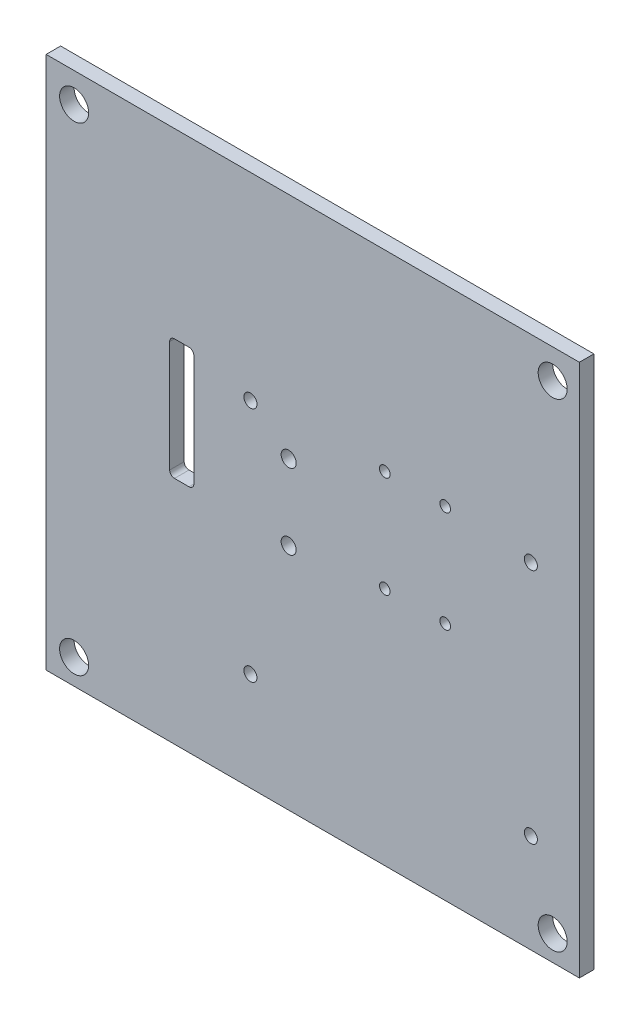
ISO-10303-21;
HEADER;
FILE_DESCRIPTION(('STEP AP214'),'2;1');
FILE_NAME('part.step','',(''),(''),'','','');
FILE_SCHEMA(('AUTOMOTIVE_DESIGN { 1 0 10303 214 1 1 1 1 }'));
ENDSEC;
DATA;
#1=APPLICATION_CONTEXT('core data for automotive mechanical design processes');
#2=APPLICATION_PROTOCOL_DEFINITION('international standard','automotive_design',2000,#1);
#3=PRODUCT_CONTEXT('',#1,'mechanical');
#4=PRODUCT('Part','Part','',(#3));
#5=PRODUCT_RELATED_PRODUCT_CATEGORY('part','',(#4));
#6=PRODUCT_DEFINITION_FORMATION('','',#4);
#7=PRODUCT_DEFINITION_CONTEXT('part definition',#1,'design');
#8=PRODUCT_DEFINITION('design','',#6,#7);
#9=PRODUCT_DEFINITION_SHAPE('','',#8);
#10=(LENGTH_UNIT() NAMED_UNIT(*) SI_UNIT(.MILLI.,.METRE.));
#11=(NAMED_UNIT(*) PLANE_ANGLE_UNIT() SI_UNIT($,.RADIAN.));
#12=(NAMED_UNIT(*) SI_UNIT($,.STERADIAN.) SOLID_ANGLE_UNIT());
#13=UNCERTAINTY_MEASURE_WITH_UNIT(LENGTH_MEASURE(1.E-05),#10,'distance_accuracy_value','');
#14=(GEOMETRIC_REPRESENTATION_CONTEXT(3) GLOBAL_UNCERTAINTY_ASSIGNED_CONTEXT((#13)) GLOBAL_UNIT_ASSIGNED_CONTEXT((#10,
#11,#12)) REPRESENTATION_CONTEXT('',''));
#15=CARTESIAN_POINT('',(0.,0.,0.));
#16=DIRECTION('',(0.,0.,1.));
#17=DIRECTION('',(1.,0.,0.));
#18=AXIS2_PLACEMENT_3D('',#15,#16,#17);
#19=CARTESIAN_POINT('',(0.,0.,998.500000000021));
#20=DIRECTION('',(0.,0.,-1.));
#21=DIRECTION('',(-1.,0.,0.));
#22=AXIS2_PLACEMENT_3D('',#19,#20,#21);
#23=PLANE('',#22);
#24=CARTESIAN_POINT('',(14.9,15.4701542651043,998.500000000021));
#25=DIRECTION('',(0.,0.,-1.));
#26=DIRECTION('',(-1.,0.,0.));
#27=AXIS2_PLACEMENT_3D('',#24,#25,#26);
#28=CIRCLE('',#27,1.1);
#29=CARTESIAN_POINT('',(13.8,15.4701542651043,998.500000000021));
#30=VERTEX_POINT('',#29);
#31=EDGE_CURVE('E174',#30,#30,#28,.T.);
#32=ORIENTED_EDGE('',*,*,#31,.F.);
#33=EDGE_LOOP('',(#32));
#34=FACE_BOUND('',#33,.T.);
#35=CARTESIAN_POINT('',(27.4000000000001,-5.52984573489571,998.500000000021));
#36=DIRECTION('',(0.,0.,1.));
#37=DIRECTION('',(1.,0.,0.));
#38=AXIS2_PLACEMENT_3D('',#35,#36,#37);
#39=CIRCLE('',#38,1.1);
#40=CARTESIAN_POINT('',(28.5000000000001,-5.52984573489571,998.500000000021));
#41=VERTEX_POINT('',#40);
#42=EDGE_CURVE('E151',#41,#41,#39,.T.);
#43=ORIENTED_EDGE('',*,*,#42,.T.);
#44=EDGE_LOOP('',(#43));
#45=FACE_BOUND('',#44,.T.);
#46=DIRECTION('',(0.,-1.,0.));
#47=VECTOR('',#46,1.);
#48=CARTESIAN_POINT('',(-24.6000000000001,16.4701542651043,998.500000000021));
#49=LINE('',#48,#47);
#50=CARTESIAN_POINT('',(-24.6000000000001,16.4701542651043,998.500000000021));
#51=VERTEX_POINT('',#50);
#52=CARTESIAN_POINT('',(-24.6000000000001,-6.52984573489571,998.500000000021));
#53=VERTEX_POINT('',#52);
#54=EDGE_CURVE('E54',#51,#53,#49,.T.);
#55=ORIENTED_EDGE('',*,*,#54,.F.);
#56=CARTESIAN_POINT('',(-25.6000000000001,16.4701542651043,998.500000000021));
#57=DIRECTION('',(0.,0.,-1.));
#58=DIRECTION('',(-1.,0.,0.));
#59=AXIS2_PLACEMENT_3D('',#56,#57,#58);
#60=CIRCLE('',#59,1.);
#61=CARTESIAN_POINT('',(-25.6000000000001,17.4701542651043,998.500000000021));
#62=VERTEX_POINT('',#61);
#63=EDGE_CURVE('E136',#62,#51,#60,.T.);
#64=ORIENTED_EDGE('',*,*,#63,.F.);
#65=DIRECTION('',(-1.,0.,0.));
#66=VECTOR('',#65,1.);
#67=CARTESIAN_POINT('',(-25.6000000000001,17.4701542651043,998.500000000021));
#68=LINE('',#67,#66);
#69=CARTESIAN_POINT('',(-28.6000000000001,17.4701542651043,998.500000000021));
#70=VERTEX_POINT('',#69);
#71=EDGE_CURVE('E141',#62,#70,#68,.T.);
#72=ORIENTED_EDGE('',*,*,#71,.T.);
#73=CARTESIAN_POINT('',(-28.6000000000001,16.4701542651043,998.500000000021));
#74=DIRECTION('',(0.,0.,1.));
#75=DIRECTION('',(1.,0.,0.));
#76=AXIS2_PLACEMENT_3D('',#73,#74,#75);
#77=CIRCLE('',#76,1.);
#78=CARTESIAN_POINT('',(-29.6000000000001,16.4701542651043,998.500000000021));
#79=VERTEX_POINT('',#78);
#80=EDGE_CURVE('E418',#70,#79,#77,.T.);
#81=ORIENTED_EDGE('',*,*,#80,.T.);
#82=DIRECTION('',(0.,-1.,0.));
#83=VECTOR('',#82,1.);
#84=CARTESIAN_POINT('',(-29.6000000000001,16.4701542651043,998.500000000021));
#85=LINE('',#84,#83);
#86=CARTESIAN_POINT('',(-29.6000000000001,-6.52984573489571,998.500000000021));
#87=VERTEX_POINT('',#86);
#88=EDGE_CURVE('E421',#79,#87,#85,.T.);
#89=ORIENTED_EDGE('',*,*,#88,.T.);
#90=CARTESIAN_POINT('',(-28.6000000000001,-6.52984573489571,998.500000000021));
#91=DIRECTION('',(0.,0.,-1.));
#92=DIRECTION('',(-1.,0.,0.));
#93=AXIS2_PLACEMENT_3D('',#90,#91,#92);
#94=CIRCLE('',#93,1.);
#95=CARTESIAN_POINT('',(-28.6000000000001,-7.52984573489571,998.500000000021));
#96=VERTEX_POINT('',#95);
#97=EDGE_CURVE('E424',#96,#87,#94,.T.);
#98=ORIENTED_EDGE('',*,*,#97,.F.);
#99=DIRECTION('',(-1.,0.,0.));
#100=VECTOR('',#99,1.);
#101=CARTESIAN_POINT('',(-25.6000000000001,-7.52984573489571,998.500000000021));
#102=LINE('',#101,#100);
#103=CARTESIAN_POINT('',(-25.6000000000001,-7.52984573489571,998.500000000021));
#104=VERTEX_POINT('',#103);
#105=EDGE_CURVE('E153',#104,#96,#102,.T.);
#106=ORIENTED_EDGE('',*,*,#105,.F.);
#107=CARTESIAN_POINT('',(-25.6000000000001,-6.52984573489571,998.500000000021));
#108=DIRECTION('',(0.,0.,-1.));
#109=DIRECTION('',(-1.,0.,0.));
#110=AXIS2_PLACEMENT_3D('',#107,#108,#109);
#111=CIRCLE('',#110,1.);
#112=EDGE_CURVE('E147',#53,#104,#111,.T.);
#113=ORIENTED_EDGE('',*,*,#112,.F.);
#114=EDGE_LOOP('',(#55,#64,#72,#81,#89,#98,#106,#113));
#115=FACE_BOUND('',#114,.T.);
#116=CARTESIAN_POINT('',(27.4,15.4701542651043,998.500000000021));
#117=DIRECTION('',(0.,0.,-1.));
#118=DIRECTION('',(-1.,0.,0.));
#119=AXIS2_PLACEMENT_3D('',#116,#117,#118);
#120=CIRCLE('',#119,1.1);
#121=CARTESIAN_POINT('',(26.3,15.4701542651043,998.500000000021));
#122=VERTEX_POINT('',#121);
#123=EDGE_CURVE('E177',#122,#122,#120,.T.);
#124=ORIENTED_EDGE('',*,*,#123,.F.);
#125=EDGE_LOOP('',(#124));
#126=FACE_BOUND('',#125,.T.);
#127=CARTESIAN_POINT('',(-4.98093579391663,7.77875,998.500000000021));
#128=DIRECTION('',(0.,0.,-1.));
#129=DIRECTION('',(-1.,0.,0.));
#130=AXIS2_PLACEMENT_3D('',#127,#128,#129);
#131=CIRCLE('',#130,1.55575);
#132=CARTESIAN_POINT('',(-6.53668579391663,7.77875,998.500000000021));
#133=VERTEX_POINT('',#132);
#134=EDGE_CURVE('E197',#133,#133,#131,.T.);
#135=ORIENTED_EDGE('',*,*,#134,.F.);
#136=EDGE_LOOP('',(#135));
#137=FACE_BOUND('',#136,.T.);
#138=CARTESIAN_POINT('',(-4.98093579391663,-7.77875,998.500000000021));
#139=DIRECTION('',(0.,0.,-1.));
#140=DIRECTION('',(-1.,0.,0.));
#141=AXIS2_PLACEMENT_3D('',#138,#139,#140);
#142=CIRCLE('',#141,1.55575);
#143=CARTESIAN_POINT('',(-6.53668579391663,-7.77875,998.500000000021));
#144=VERTEX_POINT('',#143);
#145=EDGE_CURVE('E200',#144,#144,#142,.T.);
#146=ORIENTED_EDGE('',*,*,#145,.F.);
#147=EDGE_LOOP('',(#146));
#148=FACE_BOUND('',#147,.T.);
#149=CARTESIAN_POINT('',(45.1146732207479,14.2701542651047,998.500000000021));
#150=DIRECTION('',(0.,0.,-1.));
#151=DIRECTION('',(-1.,0.,0.));
#152=AXIS2_PLACEMENT_3D('',#149,#150,#151);
#153=CIRCLE('',#152,1.35);
#154=CARTESIAN_POINT('',(43.7646732207479,14.2701542651047,998.500000000021));
#155=VERTEX_POINT('',#154);
#156=EDGE_CURVE('E218',#155,#155,#153,.T.);
#157=ORIENTED_EDGE('',*,*,#156,.F.);
#158=EDGE_LOOP('',(#157));
#159=FACE_BOUND('',#158,.T.);
#160=CARTESIAN_POINT('',(45.1146732207481,-34.7298457348953,998.500000000021));
#161=DIRECTION('',(0.,0.,-1.));
#162=DIRECTION('',(-1.,0.,0.));
#163=AXIS2_PLACEMENT_3D('',#160,#161,#162);
#164=CIRCLE('',#163,1.35000000000014);
#165=CARTESIAN_POINT('',(43.7646732207479,-34.7298457348953,998.500000000021));
#166=VERTEX_POINT('',#165);
#167=EDGE_CURVE('E212',#166,#166,#164,.T.);
#168=ORIENTED_EDGE('',*,*,#167,.F.);
#169=EDGE_LOOP('',(#168));
#170=FACE_BOUND('',#169,.T.);
#171=CARTESIAN_POINT('',(-12.8853267792518,-34.7298457348957,998.500000000021));
#172=DIRECTION('',(0.,0.,-1.));
#173=DIRECTION('',(-1.,0.,0.));
#174=AXIS2_PLACEMENT_3D('',#171,#172,#173);
#175=CIRCLE('',#174,1.35);
#176=CARTESIAN_POINT('',(-14.2353267792518,-34.7298457348957,998.500000000021));
#177=VERTEX_POINT('',#176);
#178=EDGE_CURVE('E205',#177,#177,#175,.T.);
#179=ORIENTED_EDGE('',*,*,#178,.F.);
#180=EDGE_LOOP('',(#179));
#181=FACE_BOUND('',#180,.T.);
#182=CARTESIAN_POINT('',(-12.8853267792523,14.2701542651043,998.500000000021));
#183=DIRECTION('',(0.,0.,-1.));
#184=DIRECTION('',(-1.,0.,0.));
#185=AXIS2_PLACEMENT_3D('',#182,#183,#184);
#186=CIRCLE('',#185,1.35000000000013);
#187=CARTESIAN_POINT('',(-14.2353267792524,14.2701542651043,998.500000000021));
#188=VERTEX_POINT('',#187);
#189=EDGE_CURVE('E208',#188,#188,#186,.T.);
#190=ORIENTED_EDGE('',*,*,#189,.F.);
#191=EDGE_LOOP('',(#190));
#192=FACE_BOUND('',#191,.T.);
#193=CARTESIAN_POINT('',(49.6312888891551,49.0686864415892,998.500000000021));
#194=DIRECTION('',(0.,0.,1.));
#195=DIRECTION('',(1.,0.,0.));
#196=AXIS2_PLACEMENT_3D('',#193,#194,#195);
#197=CIRCLE('',#196,2.99999999999105);
#198=CARTESIAN_POINT('',(52.6312888891462,49.0686864415892,998.500000000021));
#199=VERTEX_POINT('',#198);
#200=EDGE_CURVE('E229',#199,#199,#197,.T.);
#201=ORIENTED_EDGE('',*,*,#200,.T.);
#202=EDGE_LOOP('',(#201));
#203=FACE_BOUND('',#202,.T.);
#204=CARTESIAN_POINT('',(-49.3636604769884,-49.9262629245005,998.500000000021));
#205=DIRECTION('',(0.,0.,1.));
#206=DIRECTION('',(1.,0.,0.));
#207=AXIS2_PLACEMENT_3D('',#204,#205,#206);
#208=CIRCLE('',#207,3.00000000000893);
#209=CARTESIAN_POINT('',(-46.3636604769795,-49.9262629245005,998.500000000021));
#210=VERTEX_POINT('',#209);
#211=EDGE_CURVE('E235',#210,#210,#208,.T.);
#212=ORIENTED_EDGE('',*,*,#211,.T.);
#213=EDGE_LOOP('',(#212));
#214=FACE_BOUND('',#213,.T.);
#215=CARTESIAN_POINT('',(49.6312888891282,-49.9262629245274,998.500000000021));
#216=DIRECTION('',(0.,0.,1.));
#217=DIRECTION('',(1.,0.,0.));
#218=AXIS2_PLACEMENT_3D('',#215,#216,#217);
#219=CIRCLE('',#218,3.00000000001683);
#220=CARTESIAN_POINT('',(52.631288889145,-49.9262629245274,998.500000000021));
#221=VERTEX_POINT('',#220);
#222=EDGE_CURVE('E241',#221,#221,#219,.T.);
#223=ORIENTED_EDGE('',*,*,#222,.T.);
#224=EDGE_LOOP('',(#223));
#225=FACE_BOUND('',#224,.T.);
#226=CARTESIAN_POINT('',(-49.3636604769615,49.0686864416162,998.500000000021));
#227=DIRECTION('',(0.,0.,1.));
#228=DIRECTION('',(1.,0.,0.));
#229=AXIS2_PLACEMENT_3D('',#226,#227,#228);
#230=CIRCLE('',#229,2.99999999998319);
#231=CARTESIAN_POINT('',(-46.3636604769783,49.0686864416162,998.500000000021));
#232=VERTEX_POINT('',#231);
#233=EDGE_CURVE('E247',#232,#232,#230,.T.);
#234=ORIENTED_EDGE('',*,*,#233,.T.);
#235=EDGE_LOOP('',(#234));
#236=FACE_BOUND('',#235,.T.);
#237=DIRECTION('',(0.,-1.,0.));
#238=VECTOR('',#237,1.);
#239=CARTESIAN_POINT('',(-55.1543289325508,-55.1543289325508,998.500000000021));
#240=LINE('',#239,#238);
#241=CARTESIAN_POINT('',(-55.1543289325506,55.1543289325506,998.500000000021));
#242=VERTEX_POINT('',#241);
#243=CARTESIAN_POINT('',(-55.1543289325508,-55.1543289325508,998.500000000021));
#244=VERTEX_POINT('',#243);
#245=EDGE_CURVE('E253',#242,#244,#240,.T.);
#246=ORIENTED_EDGE('',*,*,#245,.F.);
#247=DIRECTION('',(-1.,0.,0.));
#248=VECTOR('',#247,1.);
#249=CARTESIAN_POINT('',(-55.1543289325506,55.1543289325506,998.500000000021));
#250=LINE('',#249,#248);
#251=CARTESIAN_POINT('',(55.1543289325504,55.1543289325504,998.500000000021));
#252=VERTEX_POINT('',#251);
#253=EDGE_CURVE('E263',#252,#242,#250,.T.);
#254=ORIENTED_EDGE('',*,*,#253,.F.);
#255=DIRECTION('',(0.,1.,0.));
#256=VECTOR('',#255,1.);
#257=CARTESIAN_POINT('',(55.1543289325504,-55.1543289325508,998.500000000021));
#258=LINE('',#257,#256);
#259=CARTESIAN_POINT('',(55.1543289325504,-55.1543289325508,998.500000000021));
#260=VERTEX_POINT('',#259);
#261=EDGE_CURVE('E260',#260,#252,#258,.T.);
#262=ORIENTED_EDGE('',*,*,#261,.F.);
#263=DIRECTION('',(1.,0.,0.));
#264=VECTOR('',#263,1.);
#265=CARTESIAN_POINT('',(-55.1543289325508,-55.1543289325508,998.500000000021));
#266=LINE('',#265,#264);
#267=EDGE_CURVE('E256',#244,#260,#266,.T.);
#268=ORIENTED_EDGE('',*,*,#267,.F.);
#269=EDGE_LOOP('',(#246,#254,#262,#268));
#270=FACE_BOUND('',#269,.T.);
#271=CARTESIAN_POINT('',(14.9000000000001,-5.52984573489572,998.500000000021));
#272=DIRECTION('',(0.,0.,1.));
#273=DIRECTION('',(1.,0.,0.));
#274=AXIS2_PLACEMENT_3D('',#271,#272,#273);
#275=CIRCLE('',#274,1.1);
#276=CARTESIAN_POINT('',(16.0000000000001,-5.52984573489572,998.500000000021));
#277=VERTEX_POINT('',#276);
#278=EDGE_CURVE('E181',#277,#277,#275,.T.);
#279=ORIENTED_EDGE('',*,*,#278,.T.);
#280=EDGE_LOOP('',(#279));
#281=FACE_BOUND('',#280,.T.);
#282=ADVANCED_FACE('F37',(#34,#45,#115,#126,#137,#148,#159,#170,#181,#192,#203,#214,#225,#236,
#270,#281),#23,.T.);
#283=CARTESIAN_POINT('',(0.,0.,1001.50000000002));
#284=DIRECTION('',(0.,0.,-1.));
#285=DIRECTION('',(-1.,0.,0.));
#286=AXIS2_PLACEMENT_3D('',#283,#284,#285);
#287=PLANE('',#286);
#288=CARTESIAN_POINT('',(14.9,15.4701542651043,1001.50000000002));
#289=DIRECTION('',(0.,0.,-1.));
#290=DIRECTION('',(-1.,0.,0.));
#291=AXIS2_PLACEMENT_3D('',#288,#289,#290);
#292=CIRCLE('',#291,1.1);
#293=CARTESIAN_POINT('',(13.8,15.4701542651043,1001.50000000002));
#294=VERTEX_POINT('',#293);
#295=EDGE_CURVE('E178',#294,#294,#292,.T.);
#296=ORIENTED_EDGE('',*,*,#295,.T.);
#297=EDGE_LOOP('',(#296));
#298=FACE_BOUND('',#297,.T.);
#299=CARTESIAN_POINT('',(-25.6000000000001,16.4701542651043,1001.50000000002));
#300=DIRECTION('',(0.,0.,-1.));
#301=DIRECTION('',(-1.,0.,0.));
#302=AXIS2_PLACEMENT_3D('',#299,#300,#301);
#303=CIRCLE('',#302,1.);
#304=CARTESIAN_POINT('',(-25.6000000000001,17.4701542651043,1001.50000000002));
#305=VERTEX_POINT('',#304);
#306=CARTESIAN_POINT('',(-24.6000000000001,16.4701542651043,1001.50000000002));
#307=VERTEX_POINT('',#306);
#308=EDGE_CURVE('E157',#305,#307,#303,.T.);
#309=ORIENTED_EDGE('',*,*,#308,.T.);
#310=DIRECTION('',(0.,-1.,0.));
#311=VECTOR('',#310,1.);
#312=CARTESIAN_POINT('',(-24.6000000000001,16.4701542651043,1001.50000000002));
#313=LINE('',#312,#311);
#314=CARTESIAN_POINT('',(-24.6000000000001,-6.52984573489571,1001.50000000002));
#315=VERTEX_POINT('',#314);
#316=EDGE_CURVE('E129',#307,#315,#313,.T.);
#317=ORIENTED_EDGE('',*,*,#316,.T.);
#318=CARTESIAN_POINT('',(-25.6000000000001,-6.52984573489571,1001.50000000002));
#319=DIRECTION('',(0.,0.,-1.));
#320=DIRECTION('',(-1.,0.,0.));
#321=AXIS2_PLACEMENT_3D('',#318,#319,#320);
#322=CIRCLE('',#321,1.);
#323=CARTESIAN_POINT('',(-25.6000000000001,-7.52984573489571,1001.50000000002));
#324=VERTEX_POINT('',#323);
#325=EDGE_CURVE('E170',#315,#324,#322,.T.);
#326=ORIENTED_EDGE('',*,*,#325,.T.);
#327=DIRECTION('',(-1.,0.,0.));
#328=VECTOR('',#327,1.);
#329=CARTESIAN_POINT('',(-25.6000000000001,-7.52984573489571,1001.50000000002));
#330=LINE('',#329,#328);
#331=CARTESIAN_POINT('',(-28.6000000000001,-7.52984573489571,1001.50000000002));
#332=VERTEX_POINT('',#331);
#333=EDGE_CURVE('E62',#324,#332,#330,.T.);
#334=ORIENTED_EDGE('',*,*,#333,.T.);
#335=CARTESIAN_POINT('',(-28.6000000000001,-6.52984573489571,1001.50000000002));
#336=DIRECTION('',(0.,0.,-1.));
#337=DIRECTION('',(-1.,0.,0.));
#338=AXIS2_PLACEMENT_3D('',#335,#336,#337);
#339=CIRCLE('',#338,1.);
#340=CARTESIAN_POINT('',(-29.6000000000001,-6.52984573489571,1001.50000000002));
#341=VERTEX_POINT('',#340);
#342=EDGE_CURVE('E166',#332,#341,#339,.T.);
#343=ORIENTED_EDGE('',*,*,#342,.T.);
#344=DIRECTION('',(0.,-1.,0.));
#345=VECTOR('',#344,1.);
#346=CARTESIAN_POINT('',(-29.6000000000001,16.4701542651043,1001.50000000002));
#347=LINE('',#346,#345);
#348=CARTESIAN_POINT('',(-29.6000000000001,16.4701542651043,1001.50000000002));
#349=VERTEX_POINT('',#348);
#350=EDGE_CURVE('E164',#349,#341,#347,.T.);
#351=ORIENTED_EDGE('',*,*,#350,.F.);
#352=CARTESIAN_POINT('',(-28.6000000000001,16.4701542651043,1001.50000000002));
#353=DIRECTION('',(0.,0.,1.));
#354=DIRECTION('',(1.,0.,0.));
#355=AXIS2_PLACEMENT_3D('',#352,#353,#354);
#356=CIRCLE('',#355,1.);
#357=CARTESIAN_POINT('',(-28.6000000000001,17.4701542651043,1001.50000000002));
#358=VERTEX_POINT('',#357);
#359=EDGE_CURVE('E162',#358,#349,#356,.T.);
#360=ORIENTED_EDGE('',*,*,#359,.F.);
#361=DIRECTION('',(-1.,0.,0.));
#362=VECTOR('',#361,1.);
#363=CARTESIAN_POINT('',(-25.6000000000001,17.4701542651043,1001.50000000002));
#364=LINE('',#363,#362);
#365=EDGE_CURVE('E159',#305,#358,#364,.T.);
#366=ORIENTED_EDGE('',*,*,#365,.F.);
#367=EDGE_LOOP('',(#309,#317,#326,#334,#343,#351,#360,#366));
#368=FACE_BOUND('',#367,.T.);
#369=CARTESIAN_POINT('',(27.4,15.4701542651043,1001.50000000002));
#370=DIRECTION('',(0.,0.,-1.));
#371=DIRECTION('',(-1.,0.,0.));
#372=AXIS2_PLACEMENT_3D('',#369,#370,#371);
#373=CIRCLE('',#372,1.1);
#374=CARTESIAN_POINT('',(26.3,15.4701542651043,1001.50000000002));
#375=VERTEX_POINT('',#374);
#376=EDGE_CURVE('E187',#375,#375,#373,.T.);
#377=ORIENTED_EDGE('',*,*,#376,.T.);
#378=EDGE_LOOP('',(#377));
#379=FACE_BOUND('',#378,.T.);
#380=CARTESIAN_POINT('',(-4.98093579391663,7.77875,1001.50000000002));
#381=DIRECTION('',(0.,0.,-1.));
#382=DIRECTION('',(-1.,0.,0.));
#383=AXIS2_PLACEMENT_3D('',#380,#381,#382);
#384=CIRCLE('',#383,1.55575);
#385=CARTESIAN_POINT('',(-6.53668579391663,7.77875,1001.50000000002));
#386=VERTEX_POINT('',#385);
#387=EDGE_CURVE('E193',#386,#386,#384,.T.);
#388=ORIENTED_EDGE('',*,*,#387,.T.);
#389=EDGE_LOOP('',(#388));
#390=FACE_BOUND('',#389,.T.);
#391=CARTESIAN_POINT('',(-4.98093579391663,-7.77875,1001.50000000002));
#392=DIRECTION('',(0.,0.,-1.));
#393=DIRECTION('',(-1.,0.,0.));
#394=AXIS2_PLACEMENT_3D('',#391,#392,#393);
#395=CIRCLE('',#394,1.55575);
#396=CARTESIAN_POINT('',(-6.53668579391663,-7.77875,1001.50000000002));
#397=VERTEX_POINT('',#396);
#398=EDGE_CURVE('E190',#397,#397,#395,.T.);
#399=ORIENTED_EDGE('',*,*,#398,.T.);
#400=EDGE_LOOP('',(#399));
#401=FACE_BOUND('',#400,.T.);
#402=CARTESIAN_POINT('',(45.1146732207479,14.2701542651047,1001.50000000002));
#403=DIRECTION('',(0.,0.,-1.));
#404=DIRECTION('',(-1.,0.,0.));
#405=AXIS2_PLACEMENT_3D('',#402,#403,#404);
#406=CIRCLE('',#405,1.35);
#407=CARTESIAN_POINT('',(43.7646732207479,14.2701542651047,1001.50000000002));
#408=VERTEX_POINT('',#407);
#409=EDGE_CURVE('E196',#408,#408,#406,.T.);
#410=ORIENTED_EDGE('',*,*,#409,.T.);
#411=EDGE_LOOP('',(#410));
#412=FACE_BOUND('',#411,.T.);
#413=CARTESIAN_POINT('',(45.1146732207481,-34.7298457348953,1001.50000000002));
#414=DIRECTION('',(0.,0.,-1.));
#415=DIRECTION('',(-1.,0.,0.));
#416=AXIS2_PLACEMENT_3D('',#413,#414,#415);
#417=CIRCLE('',#416,1.35000000000014);
#418=CARTESIAN_POINT('',(43.7646732207479,-34.7298457348953,1001.50000000002));
#419=VERTEX_POINT('',#418);
#420=EDGE_CURVE('E215',#419,#419,#417,.T.);
#421=ORIENTED_EDGE('',*,*,#420,.T.);
#422=EDGE_LOOP('',(#421));
#423=FACE_BOUND('',#422,.T.);
#424=CARTESIAN_POINT('',(-12.8853267792518,-34.7298457348957,1001.50000000002));
#425=DIRECTION('',(0.,0.,-1.));
#426=DIRECTION('',(-1.,0.,0.));
#427=AXIS2_PLACEMENT_3D('',#424,#425,#426);
#428=CIRCLE('',#427,1.35);
#429=CARTESIAN_POINT('',(-14.2353267792518,-34.7298457348957,1001.50000000002));
#430=VERTEX_POINT('',#429);
#431=EDGE_CURVE('E209',#430,#430,#428,.T.);
#432=ORIENTED_EDGE('',*,*,#431,.T.);
#433=EDGE_LOOP('',(#432));
#434=FACE_BOUND('',#433,.T.);
#435=CARTESIAN_POINT('',(-12.8853267792523,14.2701542651043,1001.50000000002));
#436=DIRECTION('',(0.,0.,-1.));
#437=DIRECTION('',(-1.,0.,0.));
#438=AXIS2_PLACEMENT_3D('',#435,#436,#437);
#439=CIRCLE('',#438,1.35000000000013);
#440=CARTESIAN_POINT('',(-14.2353267792524,14.2701542651043,1001.50000000002));
#441=VERTEX_POINT('',#440);
#442=EDGE_CURVE('E223',#441,#441,#439,.T.);
#443=ORIENTED_EDGE('',*,*,#442,.T.);
#444=EDGE_LOOP('',(#443));
#445=FACE_BOUND('',#444,.T.);
#446=CARTESIAN_POINT('',(49.6312888891551,49.0686864415892,1001.50000000002));
#447=DIRECTION('',(0.,0.,1.));
#448=DIRECTION('',(1.,0.,0.));
#449=AXIS2_PLACEMENT_3D('',#446,#447,#448);
#450=CIRCLE('',#449,2.99999999999105);
#451=CARTESIAN_POINT('',(52.6312888891462,49.0686864415892,1001.50000000002));
#452=VERTEX_POINT('',#451);
#453=EDGE_CURVE('E226',#452,#452,#450,.T.);
#454=ORIENTED_EDGE('',*,*,#453,.F.);
#455=EDGE_LOOP('',(#454));
#456=FACE_BOUND('',#455,.T.);
#457=CARTESIAN_POINT('',(-49.3636604769884,-49.9262629245005,1001.50000000002));
#458=DIRECTION('',(0.,0.,1.));
#459=DIRECTION('',(1.,0.,0.));
#460=AXIS2_PLACEMENT_3D('',#457,#458,#459);
#461=CIRCLE('',#460,3.00000000000893);
#462=CARTESIAN_POINT('',(-46.3636604769795,-49.9262629245005,1001.50000000002));
#463=VERTEX_POINT('',#462);
#464=EDGE_CURVE('E232',#463,#463,#461,.T.);
#465=ORIENTED_EDGE('',*,*,#464,.F.);
#466=EDGE_LOOP('',(#465));
#467=FACE_BOUND('',#466,.T.);
#468=CARTESIAN_POINT('',(49.6312888891282,-49.9262629245274,1001.50000000002));
#469=DIRECTION('',(0.,0.,1.));
#470=DIRECTION('',(1.,0.,0.));
#471=AXIS2_PLACEMENT_3D('',#468,#469,#470);
#472=CIRCLE('',#471,3.00000000001683);
#473=CARTESIAN_POINT('',(52.631288889145,-49.9262629245274,1001.50000000002));
#474=VERTEX_POINT('',#473);
#475=EDGE_CURVE('E238',#474,#474,#472,.T.);
#476=ORIENTED_EDGE('',*,*,#475,.F.);
#477=EDGE_LOOP('',(#476));
#478=FACE_BOUND('',#477,.T.);
#479=CARTESIAN_POINT('',(-49.3636604769615,49.0686864416162,1001.50000000002));
#480=DIRECTION('',(0.,0.,1.));
#481=DIRECTION('',(1.,0.,0.));
#482=AXIS2_PLACEMENT_3D('',#479,#480,#481);
#483=CIRCLE('',#482,2.99999999998319);
#484=CARTESIAN_POINT('',(-46.3636604769783,49.0686864416162,1001.50000000002));
#485=VERTEX_POINT('',#484);
#486=EDGE_CURVE('E244',#485,#485,#483,.T.);
#487=ORIENTED_EDGE('',*,*,#486,.F.);
#488=EDGE_LOOP('',(#487));
#489=FACE_BOUND('',#488,.T.);
#490=DIRECTION('',(0.,-1.,0.));
#491=VECTOR('',#490,1.);
#492=CARTESIAN_POINT('',(-55.1543289325508,-55.1543289325508,1001.50000000002));
#493=LINE('',#492,#491);
#494=CARTESIAN_POINT('',(-55.1543289325506,55.1543289325506,1001.50000000002));
#495=VERTEX_POINT('',#494);
#496=CARTESIAN_POINT('',(-55.1543289325508,-55.1543289325508,1001.50000000002));
#497=VERTEX_POINT('',#496);
#498=EDGE_CURVE('E250',#495,#497,#493,.T.);
#499=ORIENTED_EDGE('',*,*,#498,.T.);
#500=DIRECTION('',(1.,0.,0.));
#501=VECTOR('',#500,1.);
#502=CARTESIAN_POINT('',(-55.1543289325508,-55.1543289325508,1001.50000000002));
#503=LINE('',#502,#501);
#504=CARTESIAN_POINT('',(55.1543289325504,-55.1543289325508,1001.50000000002));
#505=VERTEX_POINT('',#504);
#506=EDGE_CURVE('E268',#497,#505,#503,.T.);
#507=ORIENTED_EDGE('',*,*,#506,.T.);
#508=DIRECTION('',(0.,1.,0.));
#509=VECTOR('',#508,1.);
#510=CARTESIAN_POINT('',(55.1543289325504,-55.1543289325508,1001.50000000002));
#511=LINE('',#510,#509);
#512=CARTESIAN_POINT('',(55.1543289325504,55.1543289325504,1001.50000000002));
#513=VERTEX_POINT('',#512);
#514=EDGE_CURVE('E271',#505,#513,#511,.T.);
#515=ORIENTED_EDGE('',*,*,#514,.T.);
#516=DIRECTION('',(-1.,0.,0.));
#517=VECTOR('',#516,1.);
#518=CARTESIAN_POINT('',(-55.1543289325506,55.1543289325506,1001.50000000002));
#519=LINE('',#518,#517);
#520=EDGE_CURVE('E257',#513,#495,#519,.T.);
#521=ORIENTED_EDGE('',*,*,#520,.T.);
#522=EDGE_LOOP('',(#499,#507,#515,#521));
#523=FACE_BOUND('',#522,.T.);
#524=CARTESIAN_POINT('',(27.4000000000001,-5.52984573489571,1001.50000000002));
#525=DIRECTION('',(0.,0.,1.));
#526=DIRECTION('',(1.,0.,0.));
#527=AXIS2_PLACEMENT_3D('',#524,#525,#526);
#528=CIRCLE('',#527,1.1);
#529=CARTESIAN_POINT('',(28.5000000000001,-5.52984573489571,1001.50000000002));
#530=VERTEX_POINT('',#529);
#531=EDGE_CURVE('E148',#530,#530,#528,.T.);
#532=ORIENTED_EDGE('',*,*,#531,.F.);
#533=EDGE_LOOP('',(#532));
#534=FACE_BOUND('',#533,.T.);
#535=CARTESIAN_POINT('',(14.9000000000001,-5.52984573489572,1001.50000000002));
#536=DIRECTION('',(0.,0.,1.));
#537=DIRECTION('',(1.,0.,0.));
#538=AXIS2_PLACEMENT_3D('',#535,#536,#537);
#539=CIRCLE('',#538,1.1);
#540=CARTESIAN_POINT('',(16.0000000000001,-5.52984573489572,1001.50000000002));
#541=VERTEX_POINT('',#540);
#542=EDGE_CURVE('E184',#541,#541,#539,.T.);
#543=ORIENTED_EDGE('',*,*,#542,.F.);
#544=EDGE_LOOP('',(#543));
#545=FACE_BOUND('',#544,.T.);
#546=ADVANCED_FACE('F286',(#298,#368,#379,#390,#401,#412,#423,#434,#445,#456,#467,#478,#489,
#523,#534,#545),#287,.F.);
#547=CARTESIAN_POINT('',(-55.1543289325508,-55.1543289325508,998.500000000021));
#548=DIRECTION('',(-1.,0.,0.));
#549=DIRECTION('',(0.,-1.,0.));
#550=AXIS2_PLACEMENT_3D('',#547,#548,#549);
#551=PLANE('',#550);
#552=ORIENTED_EDGE('',*,*,#498,.F.);
#553=DIRECTION('',(0.,0.,1.));
#554=VECTOR('',#553,1.);
#555=CARTESIAN_POINT('',(-55.1543289325506,55.1543289325506,998.500000000021));
#556=LINE('',#555,#554);
#557=EDGE_CURVE('E11',#242,#495,#556,.T.);
#558=ORIENTED_EDGE('',*,*,#557,.F.);
#559=ORIENTED_EDGE('',*,*,#245,.T.);
#560=DIRECTION('',(0.,0.,1.));
#561=VECTOR('',#560,1.);
#562=CARTESIAN_POINT('',(-55.1543289325508,-55.1543289325508,998.500000000021));
#563=LINE('',#562,#561);
#564=EDGE_CURVE('E41',#244,#497,#563,.T.);
#565=ORIENTED_EDGE('',*,*,#564,.T.);
#566=EDGE_LOOP('',(#552,#558,#559,#565));
#567=FACE_BOUND('',#566,.T.);
#568=ADVANCED_FACE('F39',(#567),#551,.T.);
#569=CARTESIAN_POINT('',(-55.1543289325506,55.1543289325506,998.500000000021));
#570=DIRECTION('',(0.,1.,0.));
#571=DIRECTION('',(-1.,0.,0.));
#572=AXIS2_PLACEMENT_3D('',#569,#570,#571);
#573=PLANE('',#572);
#574=ORIENTED_EDGE('',*,*,#520,.F.);
#575=DIRECTION('',(0.,0.,1.));
#576=VECTOR('',#575,1.);
#577=CARTESIAN_POINT('',(55.1543289325504,55.1543289325504,998.500000000021));
#578=LINE('',#577,#576);
#579=EDGE_CURVE('E46',#252,#513,#578,.T.);
#580=ORIENTED_EDGE('',*,*,#579,.F.);
#581=ORIENTED_EDGE('',*,*,#253,.T.);
#582=ORIENTED_EDGE('',*,*,#557,.T.);
#583=EDGE_LOOP('',(#574,#580,#581,#582));
#584=FACE_BOUND('',#583,.T.);
#585=ADVANCED_FACE('F290',(#584),#573,.T.);
#586=CARTESIAN_POINT('',(55.1543289325504,-55.1543289325508,998.500000000021));
#587=DIRECTION('',(1.,0.,0.));
#588=DIRECTION('',(0.,0.,-1.));
#589=AXIS2_PLACEMENT_3D('',#586,#587,#588);
#590=PLANE('',#589);
#591=ORIENTED_EDGE('',*,*,#514,.F.);
#592=DIRECTION('',(0.,0.,1.));
#593=VECTOR('',#592,1.);
#594=CARTESIAN_POINT('',(55.1543289325504,-55.1543289325508,998.500000000021));
#595=LINE('',#594,#593);
#596=EDGE_CURVE('E276',#260,#505,#595,.T.);
#597=ORIENTED_EDGE('',*,*,#596,.F.);
#598=ORIENTED_EDGE('',*,*,#261,.T.);
#599=ORIENTED_EDGE('',*,*,#579,.T.);
#600=EDGE_LOOP('',(#591,#597,#598,#599));
#601=FACE_BOUND('',#600,.T.);
#602=ADVANCED_FACE('F296',(#601),#590,.T.);
#603=CARTESIAN_POINT('',(-55.1543289325508,-55.1543289325508,998.500000000021));
#604=DIRECTION('',(0.,-1.,0.));
#605=DIRECTION('',(0.,0.,-1.));
#606=AXIS2_PLACEMENT_3D('',#603,#604,#605);
#607=PLANE('',#606);
#608=ORIENTED_EDGE('',*,*,#506,.F.);
#609=ORIENTED_EDGE('',*,*,#564,.F.);
#610=ORIENTED_EDGE('',*,*,#267,.T.);
#611=ORIENTED_EDGE('',*,*,#596,.T.);
#612=EDGE_LOOP('',(#608,#609,#610,#611));
#613=FACE_BOUND('',#612,.T.);
#614=ADVANCED_FACE('F284',(#613),#607,.T.);
#615=CARTESIAN_POINT('',(-49.3636604769615,49.0686864416162,998.500000000021));
#616=DIRECTION('',(0.,0.,1.));
#617=DIRECTION('',(1.,0.,0.));
#618=AXIS2_PLACEMENT_3D('',#615,#616,#617);
#619=CYLINDRICAL_SURFACE('',#618,2.99999999998319);
#620=ORIENTED_EDGE('',*,*,#233,.F.);
#621=EDGE_LOOP('',(#620));
#622=FACE_BOUND('',#621,.T.);
#623=ORIENTED_EDGE('',*,*,#486,.T.);
#624=EDGE_LOOP('',(#623));
#625=FACE_BOUND('',#624,.T.);
#626=ADVANCED_FACE('F303',(#622,#625),#619,.F.);
#627=CARTESIAN_POINT('',(49.6312888891282,-49.9262629245274,998.500000000021));
#628=DIRECTION('',(0.,0.,1.));
#629=DIRECTION('',(1.,0.,0.));
#630=AXIS2_PLACEMENT_3D('',#627,#628,#629);
#631=CYLINDRICAL_SURFACE('',#630,3.00000000001683);
#632=ORIENTED_EDGE('',*,*,#222,.F.);
#633=EDGE_LOOP('',(#632));
#634=FACE_BOUND('',#633,.T.);
#635=ORIENTED_EDGE('',*,*,#475,.T.);
#636=EDGE_LOOP('',(#635));
#637=FACE_BOUND('',#636,.T.);
#638=ADVANCED_FACE('F318',(#634,#637),#631,.F.);
#639=CARTESIAN_POINT('',(-49.3636604769884,-49.9262629245005,998.500000000021));
#640=DIRECTION('',(0.,0.,1.));
#641=DIRECTION('',(1.,0.,0.));
#642=AXIS2_PLACEMENT_3D('',#639,#640,#641);
#643=CYLINDRICAL_SURFACE('',#642,3.00000000000893);
#644=ORIENTED_EDGE('',*,*,#211,.F.);
#645=EDGE_LOOP('',(#644));
#646=FACE_BOUND('',#645,.T.);
#647=ORIENTED_EDGE('',*,*,#464,.T.);
#648=EDGE_LOOP('',(#647));
#649=FACE_BOUND('',#648,.T.);
#650=ADVANCED_FACE('F322',(#646,#649),#643,.F.);
#651=CARTESIAN_POINT('',(49.6312888891551,49.0686864415892,998.500000000021));
#652=DIRECTION('',(0.,0.,1.));
#653=DIRECTION('',(1.,0.,0.));
#654=AXIS2_PLACEMENT_3D('',#651,#652,#653);
#655=CYLINDRICAL_SURFACE('',#654,2.99999999999105);
#656=ORIENTED_EDGE('',*,*,#200,.F.);
#657=EDGE_LOOP('',(#656));
#658=FACE_BOUND('',#657,.T.);
#659=ORIENTED_EDGE('',*,*,#453,.T.);
#660=EDGE_LOOP('',(#659));
#661=FACE_BOUND('',#660,.T.);
#662=ADVANCED_FACE('F326',(#658,#661),#655,.F.);
#663=CARTESIAN_POINT('',(-12.8853267792523,14.2701542651043,1001.50000000002));
#664=DIRECTION('',(0.,0.,-1.));
#665=DIRECTION('',(-1.,0.,0.));
#666=AXIS2_PLACEMENT_3D('',#663,#664,#665);
#667=CYLINDRICAL_SURFACE('',#666,1.35000000000013);
#668=ORIENTED_EDGE('',*,*,#442,.F.);
#669=EDGE_LOOP('',(#668));
#670=FACE_BOUND('',#669,.T.);
#671=ORIENTED_EDGE('',*,*,#189,.T.);
#672=EDGE_LOOP('',(#671));
#673=FACE_BOUND('',#672,.T.);
#674=ADVANCED_FACE('F330',(#670,#673),#667,.F.);
#675=CARTESIAN_POINT('',(-12.8853267792518,-34.7298457348957,1001.50000000002));
#676=DIRECTION('',(0.,0.,-1.));
#677=DIRECTION('',(-1.,0.,0.));
#678=AXIS2_PLACEMENT_3D('',#675,#676,#677);
#679=CYLINDRICAL_SURFACE('',#678,1.35);
#680=ORIENTED_EDGE('',*,*,#431,.F.);
#681=EDGE_LOOP('',(#680));
#682=FACE_BOUND('',#681,.T.);
#683=ORIENTED_EDGE('',*,*,#178,.T.);
#684=EDGE_LOOP('',(#683));
#685=FACE_BOUND('',#684,.T.);
#686=ADVANCED_FACE('F334',(#682,#685),#679,.F.);
#687=CARTESIAN_POINT('',(45.1146732207481,-34.7298457348953,1001.50000000002));
#688=DIRECTION('',(0.,0.,-1.));
#689=DIRECTION('',(-1.,0.,0.));
#690=AXIS2_PLACEMENT_3D('',#687,#688,#689);
#691=CYLINDRICAL_SURFACE('',#690,1.35000000000014);
#692=ORIENTED_EDGE('',*,*,#420,.F.);
#693=EDGE_LOOP('',(#692));
#694=FACE_BOUND('',#693,.T.);
#695=ORIENTED_EDGE('',*,*,#167,.T.);
#696=EDGE_LOOP('',(#695));
#697=FACE_BOUND('',#696,.T.);
#698=ADVANCED_FACE('F340',(#694,#697),#691,.F.);
#699=CARTESIAN_POINT('',(45.1146732207479,14.2701542651047,1001.50000000002));
#700=DIRECTION('',(0.,0.,-1.));
#701=DIRECTION('',(-1.,0.,0.));
#702=AXIS2_PLACEMENT_3D('',#699,#700,#701);
#703=CYLINDRICAL_SURFACE('',#702,1.35);
#704=ORIENTED_EDGE('',*,*,#409,.F.);
#705=EDGE_LOOP('',(#704));
#706=FACE_BOUND('',#705,.T.);
#707=ORIENTED_EDGE('',*,*,#156,.T.);
#708=EDGE_LOOP('',(#707));
#709=FACE_BOUND('',#708,.T.);
#710=ADVANCED_FACE('F336',(#706,#709),#703,.F.);
#711=CARTESIAN_POINT('',(-4.98093579391663,-7.77875,1001.50000000002));
#712=DIRECTION('',(0.,0.,-1.));
#713=DIRECTION('',(-1.,0.,0.));
#714=AXIS2_PLACEMENT_3D('',#711,#712,#713);
#715=CYLINDRICAL_SURFACE('',#714,1.55575);
#716=ORIENTED_EDGE('',*,*,#398,.F.);
#717=EDGE_LOOP('',(#716));
#718=FACE_BOUND('',#717,.T.);
#719=ORIENTED_EDGE('',*,*,#145,.T.);
#720=EDGE_LOOP('',(#719));
#721=FACE_BOUND('',#720,.T.);
#722=ADVANCED_FACE('F339',(#718,#721),#715,.F.);
#723=CARTESIAN_POINT('',(-4.98093579391663,7.77875,1001.50000000002));
#724=DIRECTION('',(0.,0.,-1.));
#725=DIRECTION('',(-1.,0.,0.));
#726=AXIS2_PLACEMENT_3D('',#723,#724,#725);
#727=CYLINDRICAL_SURFACE('',#726,1.55575);
#728=ORIENTED_EDGE('',*,*,#387,.F.);
#729=EDGE_LOOP('',(#728));
#730=FACE_BOUND('',#729,.T.);
#731=ORIENTED_EDGE('',*,*,#134,.T.);
#732=EDGE_LOOP('',(#731));
#733=FACE_BOUND('',#732,.T.);
#734=ADVANCED_FACE('F350',(#730,#733),#727,.F.);
#735=CARTESIAN_POINT('',(27.4,15.4701542651043,1001.50000000002));
#736=DIRECTION('',(0.,0.,-1.));
#737=DIRECTION('',(-1.,0.,0.));
#738=AXIS2_PLACEMENT_3D('',#735,#736,#737);
#739=CYLINDRICAL_SURFACE('',#738,1.1);
#740=ORIENTED_EDGE('',*,*,#376,.F.);
#741=EDGE_LOOP('',(#740));
#742=FACE_BOUND('',#741,.T.);
#743=ORIENTED_EDGE('',*,*,#123,.T.);
#744=EDGE_LOOP('',(#743));
#745=FACE_BOUND('',#744,.T.);
#746=ADVANCED_FACE('F354',(#742,#745),#739,.F.);
#747=CARTESIAN_POINT('',(-24.6000000000001,16.4701542651043,1001.50000000002));
#748=DIRECTION('',(1.,0.,0.));
#749=DIRECTION('',(0.,1.,0.));
#750=AXIS2_PLACEMENT_3D('',#747,#748,#749);
#751=PLANE('',#750);
#752=ORIENTED_EDGE('',*,*,#54,.T.);
#753=DIRECTION('',(0.,0.,-1.));
#754=VECTOR('',#753,1.);
#755=CARTESIAN_POINT('',(-24.6000000000001,-6.52984573489571,1001.50000000002));
#756=LINE('',#755,#754);
#757=EDGE_CURVE('E160',#315,#53,#756,.T.);
#758=ORIENTED_EDGE('',*,*,#757,.F.);
#759=ORIENTED_EDGE('',*,*,#316,.F.);
#760=DIRECTION('',(0.,0.,-1.));
#761=VECTOR('',#760,1.);
#762=CARTESIAN_POINT('',(-24.6000000000001,16.4701542651043,1001.50000000002));
#763=LINE('',#762,#761);
#764=EDGE_CURVE('E125',#307,#51,#763,.T.);
#765=ORIENTED_EDGE('',*,*,#764,.T.);
#766=EDGE_LOOP('',(#752,#758,#759,#765));
#767=FACE_BOUND('',#766,.T.);
#768=ADVANCED_FACE('F127',(#767),#751,.F.);
#769=CARTESIAN_POINT('',(-25.6000000000001,16.4701542651043,1001.50000000002));
#770=DIRECTION('',(0.,0.,-1.));
#771=DIRECTION('',(-1.,0.,0.));
#772=AXIS2_PLACEMENT_3D('',#769,#770,#771);
#773=CYLINDRICAL_SURFACE('',#772,1.);
#774=ORIENTED_EDGE('',*,*,#63,.T.);
#775=ORIENTED_EDGE('',*,*,#764,.F.);
#776=ORIENTED_EDGE('',*,*,#308,.F.);
#777=DIRECTION('',(0.,0.,-1.));
#778=VECTOR('',#777,1.);
#779=CARTESIAN_POINT('',(-25.6000000000001,17.4701542651043,1001.50000000002));
#780=LINE('',#779,#778);
#781=EDGE_CURVE('E133',#305,#62,#780,.T.);
#782=ORIENTED_EDGE('',*,*,#781,.T.);
#783=EDGE_LOOP('',(#774,#775,#776,#782));
#784=FACE_BOUND('',#783,.T.);
#785=ADVANCED_FACE('F137',(#784),#773,.F.);
#786=CARTESIAN_POINT('',(-25.6000000000001,17.4701542651043,1001.50000000002));
#787=DIRECTION('',(0.,-1.,0.));
#788=DIRECTION('',(0.,0.,-1.));
#789=AXIS2_PLACEMENT_3D('',#786,#787,#788);
#790=PLANE('',#789);
#791=ORIENTED_EDGE('',*,*,#71,.F.);
#792=ORIENTED_EDGE('',*,*,#781,.F.);
#793=ORIENTED_EDGE('',*,*,#365,.T.);
#794=DIRECTION('',(0.,0.,-1.));
#795=VECTOR('',#794,1.);
#796=CARTESIAN_POINT('',(-28.6000000000001,17.4701542651043,1001.50000000002));
#797=LINE('',#796,#795);
#798=EDGE_CURVE('E414',#358,#70,#797,.T.);
#799=ORIENTED_EDGE('',*,*,#798,.T.);
#800=EDGE_LOOP('',(#791,#792,#793,#799));
#801=FACE_BOUND('',#800,.T.);
#802=ADVANCED_FACE('F370',(#801),#790,.T.);
#803=CARTESIAN_POINT('',(-28.6000000000001,16.4701542651043,1001.50000000002));
#804=DIRECTION('',(0.,0.,-1.));
#805=DIRECTION('',(-1.,0.,0.));
#806=AXIS2_PLACEMENT_3D('',#803,#804,#805);
#807=CYLINDRICAL_SURFACE('',#806,1.);
#808=ORIENTED_EDGE('',*,*,#80,.F.);
#809=ORIENTED_EDGE('',*,*,#798,.F.);
#810=ORIENTED_EDGE('',*,*,#359,.T.);
#811=DIRECTION('',(0.,0.,-1.));
#812=VECTOR('',#811,1.);
#813=CARTESIAN_POINT('',(-29.6000000000001,16.4701542651043,1001.50000000002));
#814=LINE('',#813,#812);
#815=EDGE_CURVE('E412',#349,#79,#814,.T.);
#816=ORIENTED_EDGE('',*,*,#815,.T.);
#817=EDGE_LOOP('',(#808,#809,#810,#816));
#818=FACE_BOUND('',#817,.T.);
#819=ADVANCED_FACE('F373',(#818),#807,.F.);
#820=CARTESIAN_POINT('',(-29.6000000000001,16.4701542651043,1001.50000000002));
#821=DIRECTION('',(1.,0.,0.));
#822=DIRECTION('',(0.,0.,-1.));
#823=AXIS2_PLACEMENT_3D('',#820,#821,#822);
#824=PLANE('',#823);
#825=ORIENTED_EDGE('',*,*,#88,.F.);
#826=ORIENTED_EDGE('',*,*,#815,.F.);
#827=ORIENTED_EDGE('',*,*,#350,.T.);
#828=DIRECTION('',(0.,0.,-1.));
#829=VECTOR('',#828,1.);
#830=CARTESIAN_POINT('',(-29.6000000000001,-6.52984573489571,1001.50000000002));
#831=LINE('',#830,#829);
#832=EDGE_CURVE('E410',#341,#87,#831,.T.);
#833=ORIENTED_EDGE('',*,*,#832,.T.);
#834=EDGE_LOOP('',(#825,#826,#827,#833));
#835=FACE_BOUND('',#834,.T.);
#836=ADVANCED_FACE('F377',(#835),#824,.T.);
#837=CARTESIAN_POINT('',(-28.6000000000001,-6.52984573489571,1001.50000000002));
#838=DIRECTION('',(0.,0.,-1.));
#839=DIRECTION('',(-1.,0.,0.));
#840=AXIS2_PLACEMENT_3D('',#837,#838,#839);
#841=CYLINDRICAL_SURFACE('',#840,1.);
#842=ORIENTED_EDGE('',*,*,#97,.T.);
#843=ORIENTED_EDGE('',*,*,#832,.F.);
#844=ORIENTED_EDGE('',*,*,#342,.F.);
#845=DIRECTION('',(0.,0.,-1.));
#846=VECTOR('',#845,1.);
#847=CARTESIAN_POINT('',(-28.6000000000001,-7.52984573489571,1001.50000000002));
#848=LINE('',#847,#846);
#849=EDGE_CURVE('E408',#332,#96,#848,.T.);
#850=ORIENTED_EDGE('',*,*,#849,.T.);
#851=EDGE_LOOP('',(#842,#843,#844,#850));
#852=FACE_BOUND('',#851,.T.);
#853=ADVANCED_FACE('F381',(#852),#841,.F.);
#854=CARTESIAN_POINT('',(-25.6000000000001,-7.52984573489571,1001.50000000002));
#855=DIRECTION('',(0.,-1.,0.));
#856=DIRECTION('',(0.,0.,-1.));
#857=AXIS2_PLACEMENT_3D('',#854,#855,#856);
#858=PLANE('',#857);
#859=ORIENTED_EDGE('',*,*,#105,.T.);
#860=ORIENTED_EDGE('',*,*,#849,.F.);
#861=ORIENTED_EDGE('',*,*,#333,.F.);
#862=DIRECTION('',(0.,0.,-1.));
#863=VECTOR('',#862,1.);
#864=CARTESIAN_POINT('',(-25.6000000000001,-7.52984573489571,1001.50000000002));
#865=LINE('',#864,#863);
#866=EDGE_CURVE('E406',#324,#104,#865,.T.);
#867=ORIENTED_EDGE('',*,*,#866,.T.);
#868=EDGE_LOOP('',(#859,#860,#861,#867));
#869=FACE_BOUND('',#868,.T.);
#870=ADVANCED_FACE('F385',(#869),#858,.F.);
#871=CARTESIAN_POINT('',(-25.6000000000001,-6.52984573489571,1001.50000000002));
#872=DIRECTION('',(0.,0.,-1.));
#873=DIRECTION('',(-1.,0.,0.));
#874=AXIS2_PLACEMENT_3D('',#871,#872,#873);
#875=CYLINDRICAL_SURFACE('',#874,1.);
#876=ORIENTED_EDGE('',*,*,#112,.T.);
#877=ORIENTED_EDGE('',*,*,#866,.F.);
#878=ORIENTED_EDGE('',*,*,#325,.F.);
#879=ORIENTED_EDGE('',*,*,#757,.T.);
#880=EDGE_LOOP('',(#876,#877,#878,#879));
#881=FACE_BOUND('',#880,.T.);
#882=ADVANCED_FACE('F389',(#881),#875,.F.);
#883=CARTESIAN_POINT('',(27.4000000000001,-5.52984573489571,1001.50000000002));
#884=DIRECTION('',(0.,0.,-1.));
#885=DIRECTION('',(-1.,0.,0.));
#886=AXIS2_PLACEMENT_3D('',#883,#884,#885);
#887=CYLINDRICAL_SURFACE('',#886,1.1);
#888=ORIENTED_EDGE('',*,*,#531,.T.);
#889=EDGE_LOOP('',(#888));
#890=FACE_BOUND('',#889,.T.);
#891=ORIENTED_EDGE('',*,*,#42,.F.);
#892=EDGE_LOOP('',(#891));
#893=FACE_BOUND('',#892,.T.);
#894=ADVANCED_FACE('F363',(#890,#893),#887,.F.);
#895=CARTESIAN_POINT('',(14.9000000000001,-5.52984573489572,1001.50000000002));
#896=DIRECTION('',(0.,0.,-1.));
#897=DIRECTION('',(-1.,0.,0.));
#898=AXIS2_PLACEMENT_3D('',#895,#896,#897);
#899=CYLINDRICAL_SURFACE('',#898,1.1);
#900=ORIENTED_EDGE('',*,*,#542,.T.);
#901=EDGE_LOOP('',(#900));
#902=FACE_BOUND('',#901,.T.);
#903=ORIENTED_EDGE('',*,*,#278,.F.);
#904=EDGE_LOOP('',(#903));
#905=FACE_BOUND('',#904,.T.);
#906=ADVANCED_FACE('F359',(#902,#905),#899,.F.);
#907=CARTESIAN_POINT('',(14.9,15.4701542651043,1001.50000000002));
#908=DIRECTION('',(0.,0.,-1.));
#909=DIRECTION('',(-1.,0.,0.));
#910=AXIS2_PLACEMENT_3D('',#907,#908,#909);
#911=CYLINDRICAL_SURFACE('',#910,1.1);
#912=ORIENTED_EDGE('',*,*,#295,.F.);
#913=EDGE_LOOP('',(#912));
#914=FACE_BOUND('',#913,.T.);
#915=ORIENTED_EDGE('',*,*,#31,.T.);
#916=EDGE_LOOP('',(#915));
#917=FACE_BOUND('',#916,.T.);
#918=ADVANCED_FACE('F362',(#914,#917),#911,.F.);
#919=CLOSED_SHELL('',(#282,#546,#568,#585,#602,#614,#626,#638,#650,#662,#674,#686,#698,#710,
#722,#734,#746,#768,#785,#802,#819,#836,#853,#870,#882,#894,#906,#918));
#920=MANIFOLD_SOLID_BREP('B2',#919);
#921=ADVANCED_BREP_SHAPE_REPRESENTATION('',(#18,#920),#14);
#922=SHAPE_DEFINITION_REPRESENTATION(#9,#921);
ENDSEC;
END-ISO-10303-21;
